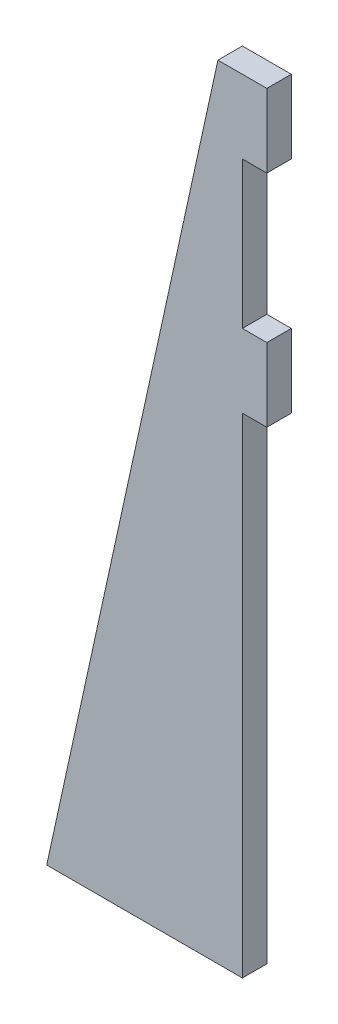
ISO-10303-21;
HEADER;
FILE_DESCRIPTION(('STEP AP214'),'2;1');
FILE_NAME('part.step','',(''),(''),'','','');
FILE_SCHEMA(('AUTOMOTIVE_DESIGN { 1 0 10303 214 1 1 1 1 }'));
ENDSEC;
DATA;
#1=APPLICATION_CONTEXT('core data for automotive mechanical design processes');
#2=APPLICATION_PROTOCOL_DEFINITION('international standard','automotive_design',2000,#1);
#3=PRODUCT_CONTEXT('',#1,'mechanical');
#4=PRODUCT('Part','Part','',(#3));
#5=PRODUCT_RELATED_PRODUCT_CATEGORY('part','',(#4));
#6=PRODUCT_DEFINITION_FORMATION('','',#4);
#7=PRODUCT_DEFINITION_CONTEXT('part definition',#1,'design');
#8=PRODUCT_DEFINITION('design','',#6,#7);
#9=PRODUCT_DEFINITION_SHAPE('','',#8);
#10=(LENGTH_UNIT() NAMED_UNIT(*) SI_UNIT(.MILLI.,.METRE.));
#11=(NAMED_UNIT(*) PLANE_ANGLE_UNIT() SI_UNIT($,.RADIAN.));
#12=(NAMED_UNIT(*) SI_UNIT($,.STERADIAN.) SOLID_ANGLE_UNIT());
#13=UNCERTAINTY_MEASURE_WITH_UNIT(LENGTH_MEASURE(1.E-05),#10,'distance_accuracy_value','');
#14=(GEOMETRIC_REPRESENTATION_CONTEXT(3) GLOBAL_UNCERTAINTY_ASSIGNED_CONTEXT((#13)) GLOBAL_UNIT_ASSIGNED_CONTEXT((#10,
#11,#12)) REPRESENTATION_CONTEXT('',''));
#15=CARTESIAN_POINT('',(0.,0.,0.));
#16=DIRECTION('',(0.,0.,1.));
#17=DIRECTION('',(1.,0.,0.));
#18=AXIS2_PLACEMENT_3D('',#15,#16,#17);
#19=CARTESIAN_POINT('',(-4.44089209850063E-13,101.6,3.175));
#20=DIRECTION('',(0.,-1.,0.));
#21=DIRECTION('',(1.,0.,0.));
#22=AXIS2_PLACEMENT_3D('',#19,#20,#21);
#23=PLANE('',#22);
#24=DIRECTION('',(-1.,0.,0.));
#25=VECTOR('',#24,1.);
#26=CARTESIAN_POINT('',(-4.44089209850063E-13,101.6,0.));
#27=LINE('',#26,#25);
#28=CARTESIAN_POINT('',(3.175,101.6,0.));
#29=VERTEX_POINT('',#28);
#30=CARTESIAN_POINT('',(-3.17500000000001,101.6,0.));
#31=VERTEX_POINT('',#30);
#32=EDGE_CURVE('E188',#29,#31,#27,.T.);
#33=ORIENTED_EDGE('',*,*,#32,.T.);
#34=DIRECTION('',(0.,0.,-1.));
#35=VECTOR('',#34,1.);
#36=CARTESIAN_POINT('',(-3.17500000000001,101.6,3.175));
#37=LINE('',#36,#35);
#38=CARTESIAN_POINT('',(-3.17500000000001,101.6,3.175));
#39=VERTEX_POINT('',#38);
#40=EDGE_CURVE('E11',#39,#31,#37,.T.);
#41=ORIENTED_EDGE('',*,*,#40,.F.);
#42=DIRECTION('',(-1.,0.,0.));
#43=VECTOR('',#42,1.);
#44=CARTESIAN_POINT('',(-4.44089209850063E-13,101.6,3.175));
#45=LINE('',#44,#43);
#46=CARTESIAN_POINT('',(3.175,101.6,3.175));
#47=VERTEX_POINT('',#46);
#48=EDGE_CURVE('E158',#47,#39,#45,.T.);
#49=ORIENTED_EDGE('',*,*,#48,.F.);
#50=DIRECTION('',(0.,0.,-1.));
#51=VECTOR('',#50,1.);
#52=CARTESIAN_POINT('',(3.175,101.6,3.175));
#53=LINE('',#52,#51);
#54=EDGE_CURVE('E55',#47,#29,#53,.T.);
#55=ORIENTED_EDGE('',*,*,#54,.T.);
#56=EDGE_LOOP('',(#33,#41,#49,#55));
#57=FACE_BOUND('',#56,.T.);
#58=ADVANCED_FACE('F39',(#57),#23,.F.);
#59=CARTESIAN_POINT('',(-24.2400745573159,5.30251630941286,3.175));
#60=DIRECTION('',(0.976900017396262,-0.213696878805432,0.));
#61=DIRECTION('',(0.213696878805432,0.976900017396262,0.));
#62=AXIS2_PLACEMENT_3D('',#59,#60,#61);
#63=PLANE('',#62);
#64=DIRECTION('',(-0.213696878805432,-0.976900017396262,0.));
#65=VECTOR('',#64,1.);
#66=CARTESIAN_POINT('',(-24.2400745573159,5.30251630941286,0.));
#67=LINE('',#66,#65);
#68=CARTESIAN_POINT('',(-25.4,0.,0.));
#69=VERTEX_POINT('',#68);
#70=EDGE_CURVE('E186',#31,#69,#67,.T.);
#71=ORIENTED_EDGE('',*,*,#70,.T.);
#72=DIRECTION('',(0.,0.,-1.));
#73=VECTOR('',#72,1.);
#74=CARTESIAN_POINT('',(-25.4,0.,3.175));
#75=LINE('',#74,#73);
#76=CARTESIAN_POINT('',(-25.4,0.,3.175));
#77=VERTEX_POINT('',#76);
#78=EDGE_CURVE('E47',#77,#69,#75,.T.);
#79=ORIENTED_EDGE('',*,*,#78,.F.);
#80=DIRECTION('',(-0.213696878805432,-0.976900017396262,0.));
#81=VECTOR('',#80,1.);
#82=CARTESIAN_POINT('',(-24.2400745573159,5.30251630941286,3.175));
#83=LINE('',#82,#81);
#84=EDGE_CURVE('E100',#39,#77,#83,.T.);
#85=ORIENTED_EDGE('',*,*,#84,.F.);
#86=ORIENTED_EDGE('',*,*,#40,.T.);
#87=EDGE_LOOP('',(#71,#79,#85,#86));
#88=FACE_BOUND('',#87,.T.);
#89=ADVANCED_FACE('F187',(#88),#63,.F.);
#90=CARTESIAN_POINT('',(0.,0.,3.175));
#91=DIRECTION('',(0.,-1.,0.));
#92=DIRECTION('',(0.,0.,-1.));
#93=AXIS2_PLACEMENT_3D('',#90,#91,#92);
#94=PLANE('',#93);
#95=DIRECTION('',(-1.,0.,0.));
#96=VECTOR('',#95,1.);
#97=CARTESIAN_POINT('',(0.,0.,0.));
#98=LINE('',#97,#96);
#99=CARTESIAN_POINT('',(0.,0.,0.));
#100=VERTEX_POINT('',#99);
#101=EDGE_CURVE('E184',#100,#69,#98,.T.);
#102=ORIENTED_EDGE('',*,*,#101,.F.);
#103=DIRECTION('',(0.,0.,-1.));
#104=VECTOR('',#103,1.);
#105=CARTESIAN_POINT('',(0.,0.,3.175));
#106=LINE('',#105,#104);
#107=CARTESIAN_POINT('',(0.,0.,3.175));
#108=VERTEX_POINT('',#107);
#109=EDGE_CURVE('E179',#108,#100,#106,.T.);
#110=ORIENTED_EDGE('',*,*,#109,.F.);
#111=DIRECTION('',(-1.,0.,0.));
#112=VECTOR('',#111,1.);
#113=CARTESIAN_POINT('',(0.,0.,3.175));
#114=LINE('',#113,#112);
#115=EDGE_CURVE('E152',#108,#77,#114,.T.);
#116=ORIENTED_EDGE('',*,*,#115,.T.);
#117=ORIENTED_EDGE('',*,*,#78,.T.);
#118=EDGE_LOOP('',(#102,#110,#116,#117));
#119=FACE_BOUND('',#118,.T.);
#120=ADVANCED_FACE('F182',(#119),#94,.T.);
#121=CARTESIAN_POINT('',(0.,0.,3.175));
#122=DIRECTION('',(1.,0.,0.));
#123=DIRECTION('',(0.,1.,0.));
#124=AXIS2_PLACEMENT_3D('',#121,#122,#123);
#125=PLANE('',#124);
#126=DIRECTION('',(0.,-1.,0.));
#127=VECTOR('',#126,1.);
#128=CARTESIAN_POINT('',(0.,0.,0.));
#129=LINE('',#128,#127);
#130=CARTESIAN_POINT('',(0.,63.5,0.));
#131=VERTEX_POINT('',#130);
#132=EDGE_CURVE('E193',#131,#100,#129,.T.);
#133=ORIENTED_EDGE('',*,*,#132,.F.);
#134=DIRECTION('',(0.,0.,-1.));
#135=VECTOR('',#134,1.);
#136=CARTESIAN_POINT('',(0.,63.5,3.175));
#137=LINE('',#136,#135);
#138=CARTESIAN_POINT('',(0.,63.5,3.175));
#139=VERTEX_POINT('',#138);
#140=EDGE_CURVE('E177',#139,#131,#137,.T.);
#141=ORIENTED_EDGE('',*,*,#140,.F.);
#142=DIRECTION('',(0.,-1.,0.));
#143=VECTOR('',#142,1.);
#144=CARTESIAN_POINT('',(0.,0.,3.175));
#145=LINE('',#144,#143);
#146=EDGE_CURVE('E145',#139,#108,#145,.T.);
#147=ORIENTED_EDGE('',*,*,#146,.T.);
#148=ORIENTED_EDGE('',*,*,#109,.T.);
#149=EDGE_LOOP('',(#133,#141,#147,#148));
#150=FACE_BOUND('',#149,.T.);
#151=ADVANCED_FACE('F216',(#150),#125,.T.);
#152=CARTESIAN_POINT('',(0.,63.5,3.175));
#153=DIRECTION('',(0.,1.,0.));
#154=DIRECTION('',(0.,0.,1.));
#155=AXIS2_PLACEMENT_3D('',#152,#153,#154);
#156=PLANE('',#155);
#157=DIRECTION('',(1.,0.,0.));
#158=VECTOR('',#157,1.);
#159=CARTESIAN_POINT('',(0.,63.5,0.));
#160=LINE('',#159,#158);
#161=CARTESIAN_POINT('',(3.175,63.5,0.));
#162=VERTEX_POINT('',#161);
#163=EDGE_CURVE('E195',#131,#162,#160,.T.);
#164=ORIENTED_EDGE('',*,*,#163,.T.);
#165=DIRECTION('',(0.,0.,-1.));
#166=VECTOR('',#165,1.);
#167=CARTESIAN_POINT('',(3.175,63.5,3.175));
#168=LINE('',#167,#166);
#169=CARTESIAN_POINT('',(3.175,63.5,3.175));
#170=VERTEX_POINT('',#169);
#171=EDGE_CURVE('E175',#170,#162,#168,.T.);
#172=ORIENTED_EDGE('',*,*,#171,.F.);
#173=DIRECTION('',(1.,0.,0.));
#174=VECTOR('',#173,1.);
#175=CARTESIAN_POINT('',(0.,63.5,3.175));
#176=LINE('',#175,#174);
#177=EDGE_CURVE('E151',#139,#170,#176,.T.);
#178=ORIENTED_EDGE('',*,*,#177,.F.);
#179=ORIENTED_EDGE('',*,*,#140,.T.);
#180=EDGE_LOOP('',(#164,#172,#178,#179));
#181=FACE_BOUND('',#180,.T.);
#182=ADVANCED_FACE('F215',(#181),#156,.F.);
#183=CARTESIAN_POINT('',(3.17500000000001,0.,3.175));
#184=DIRECTION('',(1.,0.,0.));
#185=DIRECTION('',(0.,1.,0.));
#186=AXIS2_PLACEMENT_3D('',#183,#184,#185);
#187=PLANE('',#186);
#188=DIRECTION('',(0.,-1.,0.));
#189=VECTOR('',#188,1.);
#190=CARTESIAN_POINT('',(3.17500000000001,0.,0.));
#191=LINE('',#190,#189);
#192=CARTESIAN_POINT('',(3.175,73.025,0.));
#193=VERTEX_POINT('',#192);
#194=EDGE_CURVE('E201',#193,#162,#191,.T.);
#195=ORIENTED_EDGE('',*,*,#194,.F.);
#196=DIRECTION('',(0.,0.,-1.));
#197=VECTOR('',#196,1.);
#198=CARTESIAN_POINT('',(3.175,73.025,3.175));
#199=LINE('',#198,#197);
#200=CARTESIAN_POINT('',(3.175,73.025,3.175));
#201=VERTEX_POINT('',#200);
#202=EDGE_CURVE('E173',#201,#193,#199,.T.);
#203=ORIENTED_EDGE('',*,*,#202,.F.);
#204=DIRECTION('',(0.,-1.,0.));
#205=VECTOR('',#204,1.);
#206=CARTESIAN_POINT('',(3.17500000000001,0.,3.175));
#207=LINE('',#206,#205);
#208=EDGE_CURVE('E146',#201,#170,#207,.T.);
#209=ORIENTED_EDGE('',*,*,#208,.T.);
#210=ORIENTED_EDGE('',*,*,#171,.T.);
#211=EDGE_LOOP('',(#195,#203,#209,#210));
#212=FACE_BOUND('',#211,.T.);
#213=ADVANCED_FACE('F211',(#212),#187,.T.);
#214=CARTESIAN_POINT('',(0.,73.025,3.175));
#215=DIRECTION('',(0.,1.,0.));
#216=DIRECTION('',(0.,0.,1.));
#217=AXIS2_PLACEMENT_3D('',#214,#215,#216);
#218=PLANE('',#217);
#219=DIRECTION('',(1.,0.,0.));
#220=VECTOR('',#219,1.);
#221=CARTESIAN_POINT('',(0.,73.025,0.));
#222=LINE('',#221,#220);
#223=CARTESIAN_POINT('',(0.,73.025,0.));
#224=VERTEX_POINT('',#223);
#225=EDGE_CURVE('E203',#224,#193,#222,.T.);
#226=ORIENTED_EDGE('',*,*,#225,.F.);
#227=DIRECTION('',(0.,0.,-1.));
#228=VECTOR('',#227,1.);
#229=CARTESIAN_POINT('',(0.,73.025,3.175));
#230=LINE('',#229,#228);
#231=CARTESIAN_POINT('',(0.,73.025,3.175));
#232=VERTEX_POINT('',#231);
#233=EDGE_CURVE('E131',#232,#224,#230,.T.);
#234=ORIENTED_EDGE('',*,*,#233,.F.);
#235=DIRECTION('',(1.,0.,0.));
#236=VECTOR('',#235,1.);
#237=CARTESIAN_POINT('',(0.,73.025,3.175));
#238=LINE('',#237,#236);
#239=EDGE_CURVE('E143',#232,#201,#238,.T.);
#240=ORIENTED_EDGE('',*,*,#239,.T.);
#241=ORIENTED_EDGE('',*,*,#202,.T.);
#242=EDGE_LOOP('',(#226,#234,#240,#241));
#243=FACE_BOUND('',#242,.T.);
#244=ADVANCED_FACE('F208',(#243),#218,.T.);
#245=CARTESIAN_POINT('',(0.,92.075,0.));
#246=VERTEX_POINT('',#245);
#247=EDGE_CURVE('E128',#246,#224,#129,.T.);
#248=ORIENTED_EDGE('',*,*,#247,.F.);
#249=DIRECTION('',(0.,0.,-1.));
#250=VECTOR('',#249,1.);
#251=CARTESIAN_POINT('',(0.,92.075,3.175));
#252=LINE('',#251,#250);
#253=CARTESIAN_POINT('',(0.,92.075,3.175));
#254=VERTEX_POINT('',#253);
#255=EDGE_CURVE('E122',#254,#246,#252,.T.);
#256=ORIENTED_EDGE('',*,*,#255,.F.);
#257=EDGE_CURVE('E126',#254,#232,#145,.T.);
#258=ORIENTED_EDGE('',*,*,#257,.T.);
#259=ORIENTED_EDGE('',*,*,#233,.T.);
#260=EDGE_LOOP('',(#248,#256,#258,#259));
#261=FACE_BOUND('',#260,.T.);
#262=ADVANCED_FACE('F124',(#261),#125,.T.);
#263=CARTESIAN_POINT('',(0.,92.075,3.175));
#264=DIRECTION('',(0.,1.,0.));
#265=DIRECTION('',(0.,0.,1.));
#266=AXIS2_PLACEMENT_3D('',#263,#264,#265);
#267=PLANE('',#266);
#268=DIRECTION('',(1.,0.,0.));
#269=VECTOR('',#268,1.);
#270=CARTESIAN_POINT('',(0.,92.075,0.));
#271=LINE('',#270,#269);
#272=CARTESIAN_POINT('',(3.17500000000001,92.075,0.));
#273=VERTEX_POINT('',#272);
#274=EDGE_CURVE('E164',#246,#273,#271,.T.);
#275=ORIENTED_EDGE('',*,*,#274,.T.);
#276=DIRECTION('',(0.,0.,-1.));
#277=VECTOR('',#276,1.);
#278=CARTESIAN_POINT('',(3.17500000000001,92.075,3.175));
#279=LINE('',#278,#277);
#280=CARTESIAN_POINT('',(3.17500000000001,92.075,3.175));
#281=VERTEX_POINT('',#280);
#282=EDGE_CURVE('E88',#281,#273,#279,.T.);
#283=ORIENTED_EDGE('',*,*,#282,.F.);
#284=DIRECTION('',(1.,0.,0.));
#285=VECTOR('',#284,1.);
#286=CARTESIAN_POINT('',(0.,92.075,3.175));
#287=LINE('',#286,#285);
#288=EDGE_CURVE('E133',#254,#281,#287,.T.);
#289=ORIENTED_EDGE('',*,*,#288,.F.);
#290=ORIENTED_EDGE('',*,*,#255,.T.);
#291=EDGE_LOOP('',(#275,#283,#289,#290));
#292=FACE_BOUND('',#291,.T.);
#293=ADVANCED_FACE('F134',(#292),#267,.F.);
#294=CARTESIAN_POINT('',(3.17500000000001,0.,3.175));
#295=DIRECTION('',(1.,0.,0.));
#296=DIRECTION('',(0.,1.,0.));
#297=AXIS2_PLACEMENT_3D('',#294,#295,#296);
#298=PLANE('',#297);
#299=DIRECTION('',(0.,-1.,0.));
#300=VECTOR('',#299,1.);
#301=CARTESIAN_POINT('',(3.17500000000001,0.,0.));
#302=LINE('',#301,#300);
#303=EDGE_CURVE('E161',#29,#273,#302,.T.);
#304=ORIENTED_EDGE('',*,*,#303,.F.);
#305=ORIENTED_EDGE('',*,*,#54,.F.);
#306=DIRECTION('',(0.,-1.,0.));
#307=VECTOR('',#306,1.);
#308=CARTESIAN_POINT('',(3.17500000000001,0.,3.175));
#309=LINE('',#308,#307);
#310=EDGE_CURVE('E137',#47,#281,#309,.T.);
#311=ORIENTED_EDGE('',*,*,#310,.T.);
#312=ORIENTED_EDGE('',*,*,#282,.T.);
#313=EDGE_LOOP('',(#304,#305,#311,#312));
#314=FACE_BOUND('',#313,.T.);
#315=ADVANCED_FACE('F219',(#314),#298,.T.);
#316=CARTESIAN_POINT('',(0.,0.,3.175));
#317=DIRECTION('',(0.,0.,1.));
#318=DIRECTION('',(1.,0.,0.));
#319=AXIS2_PLACEMENT_3D('',#316,#317,#318);
#320=PLANE('',#319);
#321=ORIENTED_EDGE('',*,*,#48,.T.);
#322=ORIENTED_EDGE('',*,*,#84,.T.);
#323=ORIENTED_EDGE('',*,*,#115,.F.);
#324=ORIENTED_EDGE('',*,*,#146,.F.);
#325=ORIENTED_EDGE('',*,*,#177,.T.);
#326=ORIENTED_EDGE('',*,*,#208,.F.);
#327=ORIENTED_EDGE('',*,*,#239,.F.);
#328=ORIENTED_EDGE('',*,*,#257,.F.);
#329=ORIENTED_EDGE('',*,*,#288,.T.);
#330=ORIENTED_EDGE('',*,*,#310,.F.);
#331=EDGE_LOOP('',(#321,#322,#323,#324,#325,#326,#327,#328,#329,#330));
#332=FACE_BOUND('',#331,.T.);
#333=ADVANCED_FACE('F140',(#332),#320,.T.);
#334=CARTESIAN_POINT('',(0.,0.,0.));
#335=DIRECTION('',(0.,0.,1.));
#336=DIRECTION('',(1.,0.,0.));
#337=AXIS2_PLACEMENT_3D('',#334,#335,#336);
#338=PLANE('',#337);
#339=ORIENTED_EDGE('',*,*,#32,.F.);
#340=ORIENTED_EDGE('',*,*,#303,.T.);
#341=ORIENTED_EDGE('',*,*,#274,.F.);
#342=ORIENTED_EDGE('',*,*,#247,.T.);
#343=ORIENTED_EDGE('',*,*,#225,.T.);
#344=ORIENTED_EDGE('',*,*,#194,.T.);
#345=ORIENTED_EDGE('',*,*,#163,.F.);
#346=ORIENTED_EDGE('',*,*,#132,.T.);
#347=ORIENTED_EDGE('',*,*,#101,.T.);
#348=ORIENTED_EDGE('',*,*,#70,.F.);
#349=EDGE_LOOP('',(#339,#340,#341,#342,#343,#344,#345,#346,#347,#348));
#350=FACE_BOUND('',#349,.T.);
#351=ADVANCED_FACE('F190',(#350),#338,.F.);
#352=CLOSED_SHELL('',(#58,#89,#120,#151,#182,#213,#244,#262,#293,#315,#333,#351));
#353=MANIFOLD_SOLID_BREP('B2',#352);
#354=ADVANCED_BREP_SHAPE_REPRESENTATION('',(#18,#353),#14);
#355=SHAPE_DEFINITION_REPRESENTATION(#9,#354);
ENDSEC;
END-ISO-10303-21;
